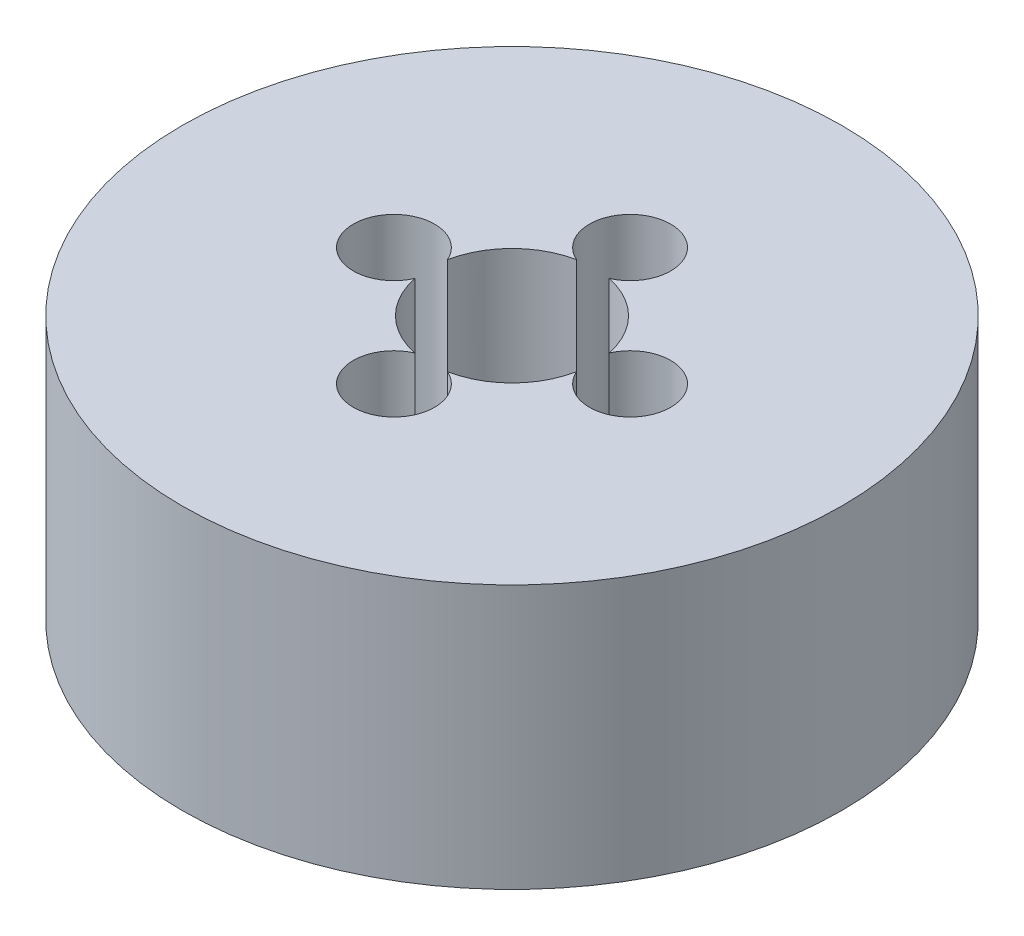
ISO-10303-21;
HEADER;
FILE_DESCRIPTION(('STEP AP214'),'2;1');
FILE_NAME('part.step','',(''),(''),'','','');
FILE_SCHEMA(('AUTOMOTIVE_DESIGN { 1 0 10303 214 1 1 1 1 }'));
ENDSEC;
DATA;
#1=APPLICATION_CONTEXT('core data for automotive mechanical design processes');
#2=APPLICATION_PROTOCOL_DEFINITION('international standard','automotive_design',2000,#1);
#3=PRODUCT_CONTEXT('',#1,'mechanical');
#4=PRODUCT('Part','Part','',(#3));
#5=PRODUCT_RELATED_PRODUCT_CATEGORY('part','',(#4));
#6=PRODUCT_DEFINITION_FORMATION('','',#4);
#7=PRODUCT_DEFINITION_CONTEXT('part definition',#1,'design');
#8=PRODUCT_DEFINITION('design','',#6,#7);
#9=PRODUCT_DEFINITION_SHAPE('','',#8);
#10=(LENGTH_UNIT() NAMED_UNIT(*) SI_UNIT(.MILLI.,.METRE.));
#11=(NAMED_UNIT(*) PLANE_ANGLE_UNIT() SI_UNIT($,.RADIAN.));
#12=(NAMED_UNIT(*) SI_UNIT($,.STERADIAN.) SOLID_ANGLE_UNIT());
#13=UNCERTAINTY_MEASURE_WITH_UNIT(LENGTH_MEASURE(1.E-05),#10,'distance_accuracy_value','');
#14=(GEOMETRIC_REPRESENTATION_CONTEXT(3) GLOBAL_UNCERTAINTY_ASSIGNED_CONTEXT((#13)) GLOBAL_UNIT_ASSIGNED_CONTEXT((#10,
#11,#12)) REPRESENTATION_CONTEXT('',''));
#15=CARTESIAN_POINT('',(0.,0.,0.));
#16=DIRECTION('',(0.,0.,1.));
#17=DIRECTION('',(1.,0.,0.));
#18=AXIS2_PLACEMENT_3D('',#15,#16,#17);
#19=CARTESIAN_POINT('',(0.,16.,0.));
#20=DIRECTION('',(0.,-1.,0.));
#21=DIRECTION('',(0.,0.,-1.));
#22=AXIS2_PLACEMENT_3D('',#19,#20,#21);
#23=CYLINDRICAL_SURFACE('',#22,20.);
#24=CARTESIAN_POINT('',(0.,16.,0.));
#25=DIRECTION('',(0.,1.,0.));
#26=DIRECTION('',(0.,0.,1.));
#27=AXIS2_PLACEMENT_3D('',#24,#25,#26);
#28=CIRCLE('',#27,20.);
#29=CARTESIAN_POINT('',(0.,16.,20.));
#30=VERTEX_POINT('',#29);
#31=EDGE_CURVE('E145',#30,#30,#28,.T.);
#32=ORIENTED_EDGE('',*,*,#31,.F.);
#33=EDGE_LOOP('',(#32));
#34=FACE_BOUND('',#33,.T.);
#35=CARTESIAN_POINT('',(0.,0.,0.));
#36=DIRECTION('',(0.,1.,0.));
#37=DIRECTION('',(0.,0.,1.));
#38=AXIS2_PLACEMENT_3D('',#35,#36,#37);
#39=CIRCLE('',#38,20.);
#40=CARTESIAN_POINT('',(0.,0.,20.));
#41=VERTEX_POINT('',#40);
#42=EDGE_CURVE('E143',#41,#41,#39,.T.);
#43=ORIENTED_EDGE('',*,*,#42,.T.);
#44=EDGE_LOOP('',(#43));
#45=FACE_BOUND('',#44,.T.);
#46=ADVANCED_FACE('F39',(#34,#45),#23,.T.);
#47=CARTESIAN_POINT('',(0.,16.,0.));
#48=DIRECTION('',(0.,1.,0.));
#49=DIRECTION('',(0.,0.,1.));
#50=AXIS2_PLACEMENT_3D('',#47,#48,#49);
#51=PLANE('',#50);
#52=CARTESIAN_POINT('',(0.,16.,7.16262886611802));
#53=DIRECTION('',(0.,1.,0.));
#54=DIRECTION('',(1.,0.,0.));
#55=AXIS2_PLACEMENT_3D('',#52,#53,#54);
#56=CIRCLE('',#55,2.46551125971262);
#57=CARTESIAN_POINT('',(-0.984359432400388,16.,4.90214611245364));
#58=VERTEX_POINT('',#57);
#59=CARTESIAN_POINT('',(0.984359432400423,16.,4.90214611245364));
#60=VERTEX_POINT('',#59);
#61=EDGE_CURVE('E152',#58,#60,#56,.T.);
#62=ORIENTED_EDGE('',*,*,#61,.F.);
#63=CARTESIAN_POINT('',(0.,16.,0.));
#64=DIRECTION('',(0.,1.,0.));
#65=DIRECTION('',(0.,0.,1.));
#66=AXIS2_PLACEMENT_3D('',#63,#64,#65);
#67=CIRCLE('',#66,5.);
#68=CARTESIAN_POINT('',(-4.90214611245364,16.,0.984359432400406));
#69=VERTEX_POINT('',#68);
#70=EDGE_CURVE('E133',#69,#58,#67,.T.);
#71=ORIENTED_EDGE('',*,*,#70,.F.);
#72=CARTESIAN_POINT('',(-7.16262886611802,16.,0.));
#73=DIRECTION('',(0.,1.,0.));
#74=DIRECTION('',(0.,0.,1.));
#75=AXIS2_PLACEMENT_3D('',#72,#73,#74);
#76=CIRCLE('',#75,2.46551125971262);
#77=CARTESIAN_POINT('',(-4.90214611245364,16.,-0.984359432400406));
#78=VERTEX_POINT('',#77);
#79=EDGE_CURVE('E128',#78,#69,#76,.T.);
#80=ORIENTED_EDGE('',*,*,#79,.F.);
#81=CARTESIAN_POINT('',(-0.984359432400457,16.,-4.90214611245363));
#82=VERTEX_POINT('',#81);
#83=EDGE_CURVE('E121',#82,#78,#67,.T.);
#84=ORIENTED_EDGE('',*,*,#83,.F.);
#85=CARTESIAN_POINT('',(0.,16.,-7.16262886611802));
#86=DIRECTION('',(0.,1.,0.));
#87=DIRECTION('',(-1.,0.,0.));
#88=AXIS2_PLACEMENT_3D('',#85,#86,#87);
#89=CIRCLE('',#88,2.46551125971262);
#90=CARTESIAN_POINT('',(0.984359432400354,16.,-4.90214611245365));
#91=VERTEX_POINT('',#90);
#92=EDGE_CURVE('E105',#91,#82,#89,.T.);
#93=ORIENTED_EDGE('',*,*,#92,.F.);
#94=CARTESIAN_POINT('',(4.90214611245364,16.,-0.984359432400406));
#95=VERTEX_POINT('',#94);
#96=EDGE_CURVE('E131',#95,#91,#67,.T.);
#97=ORIENTED_EDGE('',*,*,#96,.F.);
#98=CARTESIAN_POINT('',(7.16262886611802,16.,0.));
#99=DIRECTION('',(0.,1.,0.));
#100=DIRECTION('',(0.,0.,-1.));
#101=AXIS2_PLACEMENT_3D('',#98,#99,#100);
#102=CIRCLE('',#101,2.46551125971262);
#103=CARTESIAN_POINT('',(4.90214611245364,16.,0.984359432400406));
#104=VERTEX_POINT('',#103);
#105=EDGE_CURVE('E154',#104,#95,#102,.T.);
#106=ORIENTED_EDGE('',*,*,#105,.F.);
#107=EDGE_CURVE('E134',#60,#104,#67,.T.);
#108=ORIENTED_EDGE('',*,*,#107,.F.);
#109=EDGE_LOOP('',(#62,#71,#80,#84,#93,#97,#106,#108));
#110=FACE_BOUND('',#109,.T.);
#111=ORIENTED_EDGE('',*,*,#31,.T.);
#112=EDGE_LOOP('',(#111));
#113=FACE_BOUND('',#112,.T.);
#114=ADVANCED_FACE('F130',(#110,#113),#51,.T.);
#115=CARTESIAN_POINT('',(0.,0.,0.));
#116=DIRECTION('',(0.,1.,0.));
#117=DIRECTION('',(0.,0.,1.));
#118=AXIS2_PLACEMENT_3D('',#115,#116,#117);
#119=PLANE('',#118);
#120=CARTESIAN_POINT('',(0.,0.,0.));
#121=DIRECTION('',(0.,1.,0.));
#122=DIRECTION('',(0.,0.,1.));
#123=AXIS2_PLACEMENT_3D('',#120,#121,#122);
#124=CIRCLE('',#123,5.);
#125=CARTESIAN_POINT('',(0.,0.,5.));
#126=VERTEX_POINT('',#125);
#127=EDGE_CURVE('E135',#126,#126,#124,.T.);
#128=ORIENTED_EDGE('',*,*,#127,.T.);
#129=EDGE_LOOP('',(#128));
#130=FACE_BOUND('',#129,.T.);
#131=ORIENTED_EDGE('',*,*,#42,.F.);
#132=EDGE_LOOP('',(#131));
#133=FACE_BOUND('',#132,.T.);
#134=ADVANCED_FACE('F195',(#130,#133),#119,.F.);
#135=CARTESIAN_POINT('',(0.,16.,0.));
#136=DIRECTION('',(0.,-1.,0.));
#137=DIRECTION('',(0.,0.,-1.));
#138=AXIS2_PLACEMENT_3D('',#135,#136,#137);
#139=CYLINDRICAL_SURFACE('',#138,5.);
#140=DIRECTION('',(0.,1.,0.));
#141=VECTOR('',#140,1.);
#142=CARTESIAN_POINT('',(-0.98435943240039,9.80175068751619,4.90214611245364));
#143=LINE('',#142,#141);
#144=CARTESIAN_POINT('',(-0.984359432400388,3.60350137503238,4.90214611245364));
#145=VERTEX_POINT('',#144);
#146=EDGE_CURVE('E11',#145,#58,#143,.T.);
#147=ORIENTED_EDGE('',*,*,#146,.F.);
#148=CARTESIAN_POINT('',(0.,3.60350137503238,0.));
#149=DIRECTION('',(0.,1.,0.));
#150=DIRECTION('',(0.,0.,1.));
#151=AXIS2_PLACEMENT_3D('',#148,#149,#150);
#152=CIRCLE('',#151,5.);
#153=CARTESIAN_POINT('',(0.984359432400423,3.60350137503238,4.90214611245364));
#154=VERTEX_POINT('',#153);
#155=EDGE_CURVE('E169',#145,#154,#152,.T.);
#156=ORIENTED_EDGE('',*,*,#155,.T.);
#157=DIRECTION('',(0.,1.,0.));
#158=VECTOR('',#157,1.);
#159=CARTESIAN_POINT('',(0.984359432400424,9.80175068751619,4.90214611245364));
#160=LINE('',#159,#158);
#161=EDGE_CURVE('E46',#60,#154,#160,.F.);
#162=ORIENTED_EDGE('',*,*,#161,.F.);
#163=ORIENTED_EDGE('',*,*,#107,.T.);
#164=DIRECTION('',(0.,1.,0.));
#165=VECTOR('',#164,1.);
#166=CARTESIAN_POINT('',(4.90214611245364,9.80175068751619,0.984359432400407));
#167=LINE('',#166,#165);
#168=CARTESIAN_POINT('',(4.90214611245364,3.60350137503238,0.984359432400406));
#169=VERTEX_POINT('',#168);
#170=EDGE_CURVE('E151',#169,#104,#167,.T.);
#171=ORIENTED_EDGE('',*,*,#170,.F.);
#172=CARTESIAN_POINT('',(0.,3.60350137503238,0.));
#173=DIRECTION('',(0.,1.,0.));
#174=DIRECTION('',(0.,0.,1.));
#175=AXIS2_PLACEMENT_3D('',#172,#173,#174);
#176=CIRCLE('',#175,5.);
#177=CARTESIAN_POINT('',(4.90214611245364,3.60350137503238,-0.984359432400406));
#178=VERTEX_POINT('',#177);
#179=EDGE_CURVE('E173',#169,#178,#176,.T.);
#180=ORIENTED_EDGE('',*,*,#179,.T.);
#181=DIRECTION('',(0.,1.,0.));
#182=VECTOR('',#181,1.);
#183=CARTESIAN_POINT('',(4.90214611245364,9.80175068751619,-0.984359432400407));
#184=LINE('',#183,#182);
#185=EDGE_CURVE('E168',#95,#178,#184,.F.);
#186=ORIENTED_EDGE('',*,*,#185,.F.);
#187=ORIENTED_EDGE('',*,*,#96,.T.);
#188=DIRECTION('',(0.,1.,0.));
#189=VECTOR('',#188,1.);
#190=CARTESIAN_POINT('',(0.984359432400356,9.80175068751619,-4.90214611245365));
#191=LINE('',#190,#189);
#192=CARTESIAN_POINT('',(0.984359432400354,3.60350137503238,-4.90214611245365));
#193=VERTEX_POINT('',#192);
#194=EDGE_CURVE('E108',#193,#91,#191,.T.);
#195=ORIENTED_EDGE('',*,*,#194,.F.);
#196=CARTESIAN_POINT('',(0.,3.60350137503238,0.));
#197=DIRECTION('',(0.,1.,0.));
#198=DIRECTION('',(0.,0.,1.));
#199=AXIS2_PLACEMENT_3D('',#196,#197,#198);
#200=CIRCLE('',#199,5.);
#201=CARTESIAN_POINT('',(-0.984359432400457,3.60350137503238,-4.90214611245363));
#202=VERTEX_POINT('',#201);
#203=EDGE_CURVE('E122',#193,#202,#200,.T.);
#204=ORIENTED_EDGE('',*,*,#203,.T.);
#205=DIRECTION('',(0.,1.,0.));
#206=VECTOR('',#205,1.);
#207=CARTESIAN_POINT('',(-0.984359432400458,9.80175068751619,-4.90214611245363));
#208=LINE('',#207,#206);
#209=EDGE_CURVE('E106',#82,#202,#208,.F.);
#210=ORIENTED_EDGE('',*,*,#209,.F.);
#211=ORIENTED_EDGE('',*,*,#83,.T.);
#212=DIRECTION('',(0.,1.,0.));
#213=VECTOR('',#212,1.);
#214=CARTESIAN_POINT('',(-4.90214611245364,9.80175068751619,-0.984359432400407));
#215=LINE('',#214,#213);
#216=CARTESIAN_POINT('',(-4.90214611245364,3.60350137503238,-0.984359432400406));
#217=VERTEX_POINT('',#216);
#218=EDGE_CURVE('E177',#217,#78,#215,.T.);
#219=ORIENTED_EDGE('',*,*,#218,.F.);
#220=CARTESIAN_POINT('',(0.,3.60350137503238,0.));
#221=DIRECTION('',(0.,1.,0.));
#222=DIRECTION('',(0.,0.,1.));
#223=AXIS2_PLACEMENT_3D('',#220,#221,#222);
#224=CIRCLE('',#223,5.);
#225=CARTESIAN_POINT('',(-4.90214611245364,3.60350137503238,0.984359432400406));
#226=VERTEX_POINT('',#225);
#227=EDGE_CURVE('E185',#217,#226,#224,.T.);
#228=ORIENTED_EDGE('',*,*,#227,.T.);
#229=DIRECTION('',(0.,1.,0.));
#230=VECTOR('',#229,1.);
#231=CARTESIAN_POINT('',(-4.90214611245364,9.80175068751619,0.984359432400407));
#232=LINE('',#231,#230);
#233=EDGE_CURVE('E179',#69,#226,#232,.F.);
#234=ORIENTED_EDGE('',*,*,#233,.F.);
#235=ORIENTED_EDGE('',*,*,#70,.T.);
#236=EDGE_LOOP('',(#147,#156,#162,#163,#171,#180,#186,#187,#195,#204,#210,#211,#219,#228,#234,#235));
#237=FACE_BOUND('',#236,.T.);
#238=ORIENTED_EDGE('',*,*,#127,.F.);
#239=EDGE_LOOP('',(#238));
#240=FACE_BOUND('',#239,.T.);
#241=ADVANCED_FACE('F117',(#237,#240),#139,.F.);
#242=CARTESIAN_POINT('',(-7.16262886611802,3.60350137503238,0.));
#243=DIRECTION('',(0.,1.,0.));
#244=DIRECTION('',(0.,0.,1.));
#245=AXIS2_PLACEMENT_3D('',#242,#243,#244);
#246=CYLINDRICAL_SURFACE('',#245,2.46551125971262);
#247=ORIENTED_EDGE('',*,*,#218,.T.);
#248=ORIENTED_EDGE('',*,*,#79,.T.);
#249=ORIENTED_EDGE('',*,*,#233,.T.);
#250=CARTESIAN_POINT('',(-7.16262886611802,3.60350137503238,0.));
#251=DIRECTION('',(0.,1.,0.));
#252=DIRECTION('',(0.,0.,1.));
#253=AXIS2_PLACEMENT_3D('',#250,#251,#252);
#254=CIRCLE('',#253,2.46551125971262);
#255=EDGE_CURVE('E140',#217,#226,#254,.T.);
#256=ORIENTED_EDGE('',*,*,#255,.F.);
#257=EDGE_LOOP('',(#247,#248,#249,#256));
#258=FACE_BOUND('',#257,.T.);
#259=ADVANCED_FACE('F200',(#258),#246,.F.);
#260=CARTESIAN_POINT('',(-7.16262886611802,3.60350137503238,0.));
#261=DIRECTION('',(0.,1.,0.));
#262=DIRECTION('',(0.,0.,1.));
#263=AXIS2_PLACEMENT_3D('',#260,#261,#262);
#264=PLANE('',#263);
#265=ORIENTED_EDGE('',*,*,#255,.T.);
#266=ORIENTED_EDGE('',*,*,#227,.F.);
#267=EDGE_LOOP('',(#265,#266));
#268=FACE_BOUND('',#267,.T.);
#269=ADVANCED_FACE('F202',(#268),#264,.T.);
#270=CARTESIAN_POINT('',(0.,3.60350137503238,-7.16262886611802));
#271=DIRECTION('',(0.,1.,0.));
#272=DIRECTION('',(0.,0.,1.));
#273=AXIS2_PLACEMENT_3D('',#270,#271,#272);
#274=CYLINDRICAL_SURFACE('',#273,2.46551125971262);
#275=ORIENTED_EDGE('',*,*,#194,.T.);
#276=ORIENTED_EDGE('',*,*,#92,.T.);
#277=ORIENTED_EDGE('',*,*,#209,.T.);
#278=CARTESIAN_POINT('',(0.,3.60350137503238,-7.16262886611802));
#279=DIRECTION('',(0.,1.,0.));
#280=DIRECTION('',(-1.,0.,0.));
#281=AXIS2_PLACEMENT_3D('',#278,#279,#280);
#282=CIRCLE('',#281,2.46551125971262);
#283=EDGE_CURVE('E111',#193,#202,#282,.T.);
#284=ORIENTED_EDGE('',*,*,#283,.F.);
#285=EDGE_LOOP('',(#275,#276,#277,#284));
#286=FACE_BOUND('',#285,.T.);
#287=ADVANCED_FACE('F102',(#286),#274,.F.);
#288=CARTESIAN_POINT('',(0.,3.60350137503238,-7.16262886611802));
#289=DIRECTION('',(0.,1.,0.));
#290=DIRECTION('',(-1.,0.,0.));
#291=AXIS2_PLACEMENT_3D('',#288,#289,#290);
#292=PLANE('',#291);
#293=ORIENTED_EDGE('',*,*,#283,.T.);
#294=ORIENTED_EDGE('',*,*,#203,.F.);
#295=EDGE_LOOP('',(#293,#294));
#296=FACE_BOUND('',#295,.T.);
#297=ADVANCED_FACE('F211',(#296),#292,.T.);
#298=CARTESIAN_POINT('',(7.16262886611802,3.60350137503238,0.));
#299=DIRECTION('',(0.,1.,0.));
#300=DIRECTION('',(0.,0.,1.));
#301=AXIS2_PLACEMENT_3D('',#298,#299,#300);
#302=CYLINDRICAL_SURFACE('',#301,2.46551125971262);
#303=ORIENTED_EDGE('',*,*,#170,.T.);
#304=ORIENTED_EDGE('',*,*,#105,.T.);
#305=ORIENTED_EDGE('',*,*,#185,.T.);
#306=CARTESIAN_POINT('',(7.16262886611802,3.60350137503238,0.));
#307=DIRECTION('',(0.,1.,0.));
#308=DIRECTION('',(0.,0.,-1.));
#309=AXIS2_PLACEMENT_3D('',#306,#307,#308);
#310=CIRCLE('',#309,2.46551125971262);
#311=EDGE_CURVE('E56',#169,#178,#310,.T.);
#312=ORIENTED_EDGE('',*,*,#311,.F.);
#313=EDGE_LOOP('',(#303,#304,#305,#312));
#314=FACE_BOUND('',#313,.T.);
#315=ADVANCED_FACE('F212',(#314),#302,.F.);
#316=CARTESIAN_POINT('',(7.16262886611802,3.60350137503238,0.));
#317=DIRECTION('',(0.,1.,0.));
#318=DIRECTION('',(0.,0.,-1.));
#319=AXIS2_PLACEMENT_3D('',#316,#317,#318);
#320=PLANE('',#319);
#321=ORIENTED_EDGE('',*,*,#311,.T.);
#322=ORIENTED_EDGE('',*,*,#179,.F.);
#323=EDGE_LOOP('',(#321,#322));
#324=FACE_BOUND('',#323,.T.);
#325=ADVANCED_FACE('F217',(#324),#320,.T.);
#326=CARTESIAN_POINT('',(0.,3.60350137503238,7.16262886611802));
#327=DIRECTION('',(0.,1.,0.));
#328=DIRECTION('',(0.,0.,1.));
#329=AXIS2_PLACEMENT_3D('',#326,#327,#328);
#330=CYLINDRICAL_SURFACE('',#329,2.46551125971262);
#331=ORIENTED_EDGE('',*,*,#146,.T.);
#332=ORIENTED_EDGE('',*,*,#61,.T.);
#333=ORIENTED_EDGE('',*,*,#161,.T.);
#334=CARTESIAN_POINT('',(0.,3.60350137503238,7.16262886611802));
#335=DIRECTION('',(0.,1.,0.));
#336=DIRECTION('',(1.,0.,0.));
#337=AXIS2_PLACEMENT_3D('',#334,#335,#336);
#338=CIRCLE('',#337,2.46551125971262);
#339=EDGE_CURVE('E55',#145,#154,#338,.T.);
#340=ORIENTED_EDGE('',*,*,#339,.F.);
#341=EDGE_LOOP('',(#331,#332,#333,#340));
#342=FACE_BOUND('',#341,.T.);
#343=ADVANCED_FACE('F170',(#342),#330,.F.);
#344=CARTESIAN_POINT('',(0.,3.60350137503238,7.16262886611802));
#345=DIRECTION('',(0.,1.,0.));
#346=DIRECTION('',(1.,0.,0.));
#347=AXIS2_PLACEMENT_3D('',#344,#345,#346);
#348=PLANE('',#347);
#349=ORIENTED_EDGE('',*,*,#339,.T.);
#350=ORIENTED_EDGE('',*,*,#155,.F.);
#351=EDGE_LOOP('',(#349,#350));
#352=FACE_BOUND('',#351,.T.);
#353=ADVANCED_FACE('F224',(#352),#348,.T.);
#354=CLOSED_SHELL('',(#46,#114,#134,#241,#259,#269,#287,#297,#315,#325,#343,#353));
#355=MANIFOLD_SOLID_BREP('B2',#354);
#356=ADVANCED_BREP_SHAPE_REPRESENTATION('',(#18,#355),#14);
#357=SHAPE_DEFINITION_REPRESENTATION(#9,#356);
ENDSEC;
END-ISO-10303-21;
